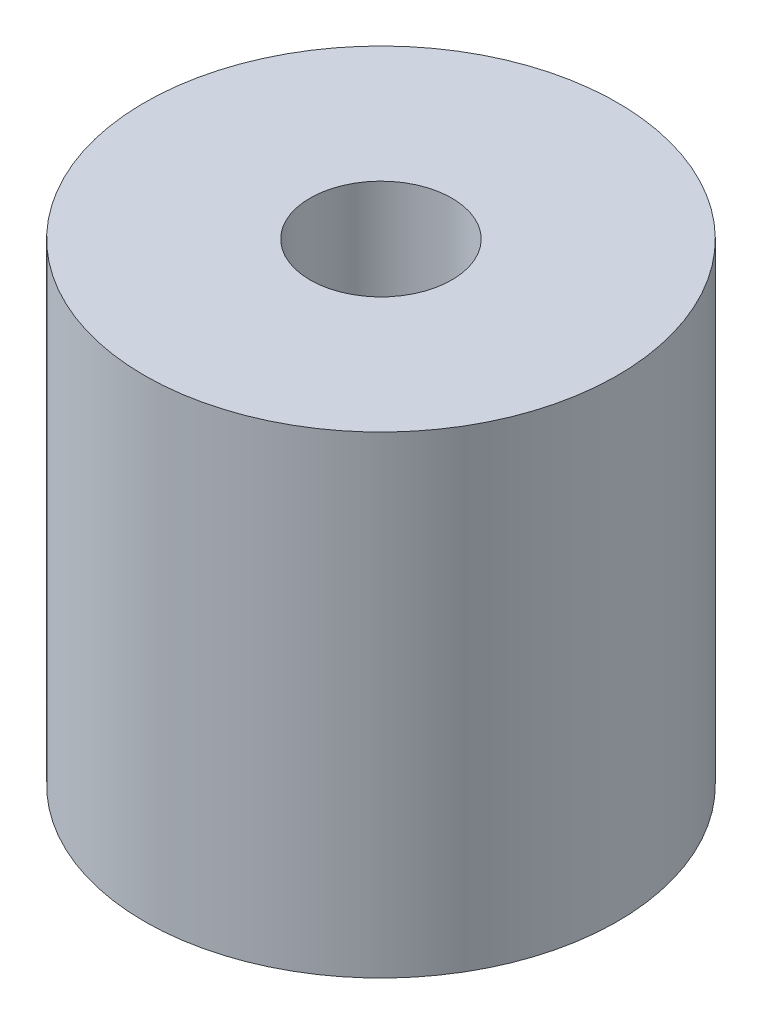
ISO-10303-21;
HEADER;
FILE_DESCRIPTION(('STEP AP214'),'2;1');
FILE_NAME('part.step','',(''),(''),'','','');
FILE_SCHEMA(('AUTOMOTIVE_DESIGN { 1 0 10303 214 1 1 1 1 }'));
ENDSEC;
DATA;
#1=APPLICATION_CONTEXT('core data for automotive mechanical design processes');
#2=APPLICATION_PROTOCOL_DEFINITION('international standard','automotive_design',2000,#1);
#3=PRODUCT_CONTEXT('',#1,'mechanical');
#4=PRODUCT('Part','Part','',(#3));
#5=PRODUCT_RELATED_PRODUCT_CATEGORY('part','',(#4));
#6=PRODUCT_DEFINITION_FORMATION('','',#4);
#7=PRODUCT_DEFINITION_CONTEXT('part definition',#1,'design');
#8=PRODUCT_DEFINITION('design','',#6,#7);
#9=PRODUCT_DEFINITION_SHAPE('','',#8);
#10=(LENGTH_UNIT() NAMED_UNIT(*) SI_UNIT(.MILLI.,.METRE.));
#11=(NAMED_UNIT(*) PLANE_ANGLE_UNIT() SI_UNIT($,.RADIAN.));
#12=(NAMED_UNIT(*) SI_UNIT($,.STERADIAN.) SOLID_ANGLE_UNIT());
#13=UNCERTAINTY_MEASURE_WITH_UNIT(LENGTH_MEASURE(1.E-05),#10,'distance_accuracy_value','');
#14=(GEOMETRIC_REPRESENTATION_CONTEXT(3) GLOBAL_UNCERTAINTY_ASSIGNED_CONTEXT((#13)) GLOBAL_UNIT_ASSIGNED_CONTEXT((#10,
#11,#12)) REPRESENTATION_CONTEXT('',''));
#15=CARTESIAN_POINT('',(0.,0.,0.));
#16=DIRECTION('',(0.,0.,1.));
#17=DIRECTION('',(1.,0.,0.));
#18=AXIS2_PLACEMENT_3D('',#15,#16,#17);
#19=CARTESIAN_POINT('',(0.,10.,0.));
#20=DIRECTION('',(0.,1.,0.));
#21=DIRECTION('',(0.,0.,1.));
#22=AXIS2_PLACEMENT_3D('',#19,#20,#21);
#23=PLANE('',#22);
#24=CARTESIAN_POINT('',(0.,10.,0.));
#25=DIRECTION('',(0.,1.,0.));
#26=DIRECTION('',(0.,0.,1.));
#27=AXIS2_PLACEMENT_3D('',#24,#25,#26);
#28=CIRCLE('',#27,5.);
#29=CARTESIAN_POINT('',(0.,10.,5.));
#30=VERTEX_POINT('',#29);
#31=EDGE_CURVE('E10',#30,#30,#28,.T.);
#32=ORIENTED_EDGE('',*,*,#31,.T.);
#33=EDGE_LOOP('',(#32));
#34=FACE_BOUND('',#33,.T.);
#35=CARTESIAN_POINT('',(0.,10.,0.));
#36=DIRECTION('',(0.,1.,0.));
#37=DIRECTION('',(0.,0.,1.));
#38=AXIS2_PLACEMENT_3D('',#35,#36,#37);
#39=CIRCLE('',#38,1.5);
#40=CARTESIAN_POINT('',(0.,10.,1.5));
#41=VERTEX_POINT('',#40);
#42=EDGE_CURVE('E56',#41,#41,#39,.T.);
#43=ORIENTED_EDGE('',*,*,#42,.F.);
#44=EDGE_LOOP('',(#43));
#45=FACE_BOUND('',#44,.T.);
#46=ADVANCED_FACE('F43',(#34,#45),#23,.T.);
#47=CARTESIAN_POINT('',(0.,0.,0.));
#48=DIRECTION('',(0.,1.,0.));
#49=DIRECTION('',(0.,0.,1.));
#50=AXIS2_PLACEMENT_3D('',#47,#48,#49);
#51=PLANE('',#50);
#52=CARTESIAN_POINT('',(0.,0.,0.));
#53=DIRECTION('',(0.,1.,0.));
#54=DIRECTION('',(0.,0.,1.));
#55=AXIS2_PLACEMENT_3D('',#52,#53,#54);
#56=CIRCLE('',#55,5.);
#57=CARTESIAN_POINT('',(0.,0.,5.));
#58=VERTEX_POINT('',#57);
#59=EDGE_CURVE('E47',#58,#58,#56,.T.);
#60=ORIENTED_EDGE('',*,*,#59,.F.);
#61=EDGE_LOOP('',(#60));
#62=FACE_BOUND('',#61,.T.);
#63=CARTESIAN_POINT('',(0.,0.,0.));
#64=DIRECTION('',(0.,1.,0.));
#65=DIRECTION('',(0.,0.,1.));
#66=AXIS2_PLACEMENT_3D('',#63,#64,#65);
#67=CIRCLE('',#66,1.5);
#68=CARTESIAN_POINT('',(0.,0.,1.5));
#69=VERTEX_POINT('',#68);
#70=EDGE_CURVE('E58',#69,#69,#67,.T.);
#71=ORIENTED_EDGE('',*,*,#70,.T.);
#72=EDGE_LOOP('',(#71));
#73=FACE_BOUND('',#72,.T.);
#74=ADVANCED_FACE('F70',(#62,#73),#51,.F.);
#75=CARTESIAN_POINT('',(0.,10.,0.));
#76=DIRECTION('',(0.,-1.,0.));
#77=DIRECTION('',(0.,0.,-1.));
#78=AXIS2_PLACEMENT_3D('',#75,#76,#77);
#79=CYLINDRICAL_SURFACE('',#78,5.);
#80=ORIENTED_EDGE('',*,*,#31,.F.);
#81=EDGE_LOOP('',(#80));
#82=FACE_BOUND('',#81,.T.);
#83=ORIENTED_EDGE('',*,*,#59,.T.);
#84=EDGE_LOOP('',(#83));
#85=FACE_BOUND('',#84,.T.);
#86=ADVANCED_FACE('F45',(#82,#85),#79,.T.);
#87=CARTESIAN_POINT('',(0.,10.,0.));
#88=DIRECTION('',(0.,-1.,0.));
#89=DIRECTION('',(0.,0.,-1.));
#90=AXIS2_PLACEMENT_3D('',#87,#88,#89);
#91=CYLINDRICAL_SURFACE('',#90,1.5);
#92=ORIENTED_EDGE('',*,*,#42,.T.);
#93=EDGE_LOOP('',(#92));
#94=FACE_BOUND('',#93,.T.);
#95=ORIENTED_EDGE('',*,*,#70,.F.);
#96=EDGE_LOOP('',(#95));
#97=FACE_BOUND('',#96,.T.);
#98=ADVANCED_FACE('F66',(#94,#97),#91,.F.);
#99=CLOSED_SHELL('',(#46,#74,#86,#98));
#100=MANIFOLD_SOLID_BREP('B2',#99);
#101=ADVANCED_BREP_SHAPE_REPRESENTATION('',(#18,#100),#14);
#102=SHAPE_DEFINITION_REPRESENTATION(#9,#101);
ENDSEC;
END-ISO-10303-21;
